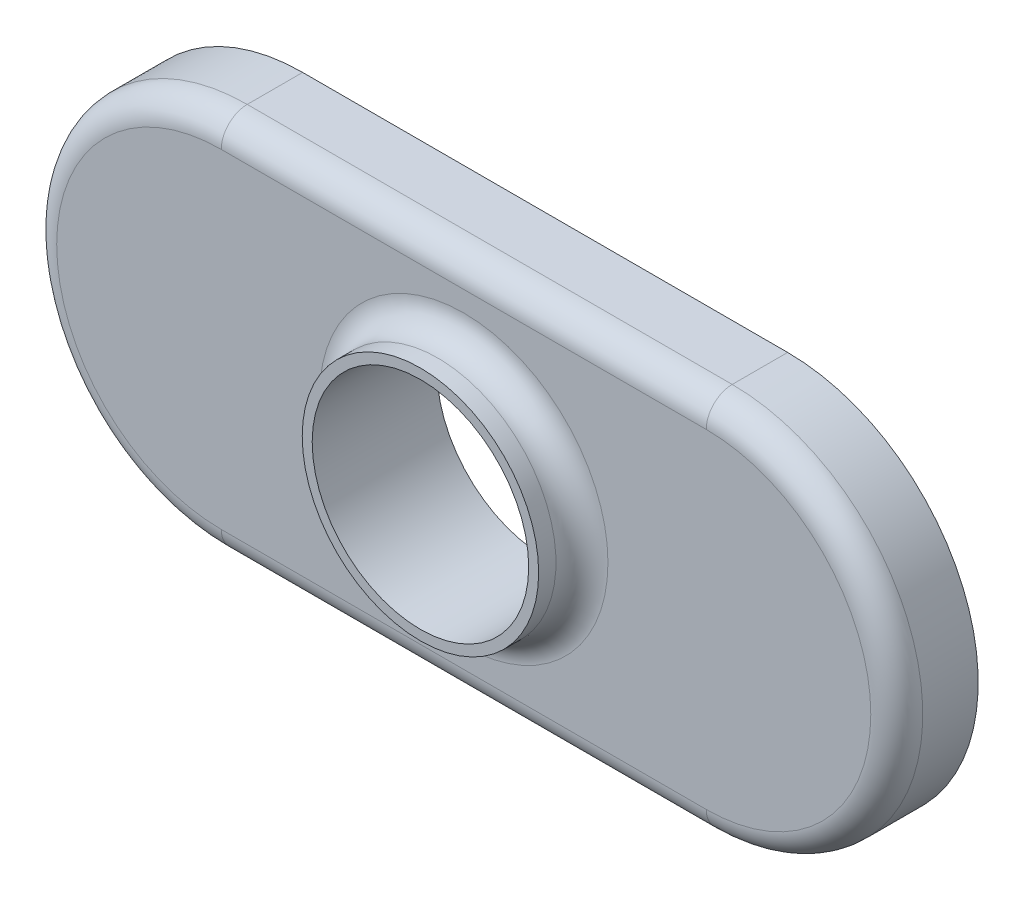
ISO-10303-21;
HEADER;
FILE_DESCRIPTION(('STEP AP214'),'2;1');
FILE_NAME('part.step','',(''),(''),'','','');
FILE_SCHEMA(('AUTOMOTIVE_DESIGN { 1 0 10303 214 1 1 1 1 }'));
ENDSEC;
DATA;
#1=APPLICATION_CONTEXT('core data for automotive mechanical design processes');
#2=APPLICATION_PROTOCOL_DEFINITION('international standard','automotive_design',2000,#1);
#3=PRODUCT_CONTEXT('',#1,'mechanical');
#4=PRODUCT('Part','Part','',(#3));
#5=PRODUCT_RELATED_PRODUCT_CATEGORY('part','',(#4));
#6=PRODUCT_DEFINITION_FORMATION('','',#4);
#7=PRODUCT_DEFINITION_CONTEXT('part definition',#1,'design');
#8=PRODUCT_DEFINITION('design','',#6,#7);
#9=PRODUCT_DEFINITION_SHAPE('','',#8);
#10=(LENGTH_UNIT() NAMED_UNIT(*) SI_UNIT(.MILLI.,.METRE.));
#11=(NAMED_UNIT(*) PLANE_ANGLE_UNIT() SI_UNIT($,.RADIAN.));
#12=(NAMED_UNIT(*) SI_UNIT($,.STERADIAN.) SOLID_ANGLE_UNIT());
#13=UNCERTAINTY_MEASURE_WITH_UNIT(LENGTH_MEASURE(1.E-05),#10,'distance_accuracy_value','');
#14=(GEOMETRIC_REPRESENTATION_CONTEXT(3) GLOBAL_UNCERTAINTY_ASSIGNED_CONTEXT((#13)) GLOBAL_UNIT_ASSIGNED_CONTEXT((#10,
#11,#12)) REPRESENTATION_CONTEXT('',''));
#15=CARTESIAN_POINT('',(0.,0.,0.));
#16=DIRECTION('',(0.,0.,1.));
#17=DIRECTION('',(1.,0.,0.));
#18=AXIS2_PLACEMENT_3D('',#15,#16,#17);
#19=CARTESIAN_POINT('',(0.,11.176,-2.3876));
#20=DIRECTION('',(0.,1.,0.));
#21=DIRECTION('',(-1.,0.,0.));
#22=AXIS2_PLACEMENT_3D('',#19,#20,#21);
#23=PLANE('',#22);
#24=DIRECTION('',(0.,0.,-1.));
#25=VECTOR('',#24,1.);
#26=CARTESIAN_POINT('',(5.588,11.176,37.9720204037097));
#27=LINE('',#26,#25);
#28=CARTESIAN_POINT('',(5.588,11.176,-0.761999999999999));
#29=VERTEX_POINT('',#28);
#30=CARTESIAN_POINT('',(5.588,11.176,-2.3876));
#31=VERTEX_POINT('',#30);
#32=EDGE_CURVE('E137',#29,#31,#27,.T.);
#33=ORIENTED_EDGE('',*,*,#32,.F.);
#34=DIRECTION('',(-1.,0.,0.));
#35=VECTOR('',#34,1.);
#36=CARTESIAN_POINT('',(19.812,11.176,-0.762));
#37=LINE('',#36,#35);
#38=CARTESIAN_POINT('',(19.812,11.176,-0.761999999999999));
#39=VERTEX_POINT('',#38);
#40=EDGE_CURVE('E129',#29,#39,#37,.F.);
#41=ORIENTED_EDGE('',*,*,#40,.T.);
#42=DIRECTION('',(0.,0.,-1.));
#43=VECTOR('',#42,1.);
#44=CARTESIAN_POINT('',(19.812,11.176,37.9720204037097));
#45=LINE('',#44,#43);
#46=CARTESIAN_POINT('',(19.812,11.176,-2.3876));
#47=VERTEX_POINT('',#46);
#48=EDGE_CURVE('E102',#39,#47,#45,.T.);
#49=ORIENTED_EDGE('',*,*,#48,.T.);
#50=DIRECTION('',(-1.,0.,0.));
#51=VECTOR('',#50,1.);
#52=CARTESIAN_POINT('',(0.,11.176,-2.3876));
#53=LINE('',#52,#51);
#54=EDGE_CURVE('E88',#47,#31,#53,.T.);
#55=ORIENTED_EDGE('',*,*,#54,.T.);
#56=EDGE_LOOP('',(#33,#41,#49,#55));
#57=FACE_BOUND('',#56,.T.);
#58=ADVANCED_FACE('F30',(#57),#23,.T.);
#59=CARTESIAN_POINT('',(0.,0.,-2.3876));
#60=DIRECTION('',(0.,0.,-1.));
#61=DIRECTION('',(-1.,0.,0.));
#62=AXIS2_PLACEMENT_3D('',#59,#60,#61);
#63=PLANE('',#62);
#64=CARTESIAN_POINT('',(5.588,5.588,-2.3876));
#65=DIRECTION('',(0.,0.,-1.));
#66=DIRECTION('',(-1.,0.,0.));
#67=AXIS2_PLACEMENT_3D('',#64,#65,#66);
#68=CIRCLE('',#67,5.588);
#69=CARTESIAN_POINT('',(5.588,0.,-2.3876));
#70=VERTEX_POINT('',#69);
#71=EDGE_CURVE('E107',#31,#70,#68,.F.);
#72=ORIENTED_EDGE('',*,*,#71,.F.);
#73=ORIENTED_EDGE('',*,*,#54,.F.);
#74=CARTESIAN_POINT('',(19.812,5.588,-2.3876));
#75=DIRECTION('',(0.,0.,-1.));
#76=DIRECTION('',(-1.,0.,0.));
#77=AXIS2_PLACEMENT_3D('',#74,#75,#76);
#78=CIRCLE('',#77,5.588);
#79=CARTESIAN_POINT('',(19.812,0.,-2.3876));
#80=VERTEX_POINT('',#79);
#81=EDGE_CURVE('E86',#47,#80,#78,.T.);
#82=ORIENTED_EDGE('',*,*,#81,.T.);
#83=DIRECTION('',(1.,0.,0.));
#84=VECTOR('',#83,1.);
#85=CARTESIAN_POINT('',(0.,0.,-2.3876));
#86=LINE('',#85,#84);
#87=EDGE_CURVE('E91',#70,#80,#86,.T.);
#88=ORIENTED_EDGE('',*,*,#87,.F.);
#89=EDGE_LOOP('',(#72,#73,#82,#88));
#90=FACE_BOUND('',#89,.T.);
#91=CARTESIAN_POINT('',(12.7,5.588,-2.3876));
#92=DIRECTION('',(0.,0.,-1.));
#93=DIRECTION('',(-1.,0.,0.));
#94=AXIS2_PLACEMENT_3D('',#91,#92,#93);
#95=CIRCLE('',#94,3.175);
#96=CARTESIAN_POINT('',(9.525,5.588,-2.3876));
#97=VERTEX_POINT('',#96);
#98=EDGE_CURVE('E105',#97,#97,#95,.T.);
#99=ORIENTED_EDGE('',*,*,#98,.F.);
#100=EDGE_LOOP('',(#99));
#101=FACE_BOUND('',#100,.T.);
#102=ADVANCED_FACE('F98',(#90,#101),#63,.T.);
#103=CARTESIAN_POINT('',(0.,0.,0.));
#104=DIRECTION('',(0.,0.,-1.));
#105=DIRECTION('',(-1.,0.,0.));
#106=AXIS2_PLACEMENT_3D('',#103,#104,#105);
#107=PLANE('',#106);
#108=CARTESIAN_POINT('',(19.812,5.588,0.));
#109=DIRECTION('',(0.,0.,-1.));
#110=DIRECTION('',(-1.,0.,0.));
#111=AXIS2_PLACEMENT_3D('',#108,#109,#110);
#112=CIRCLE('',#111,4.826);
#113=CARTESIAN_POINT('',(19.812,0.762,0.));
#114=VERTEX_POINT('',#113);
#115=CARTESIAN_POINT('',(19.812,10.414,0.));
#116=VERTEX_POINT('',#115);
#117=EDGE_CURVE('E124',#114,#116,#112,.F.);
#118=ORIENTED_EDGE('',*,*,#117,.T.);
#119=DIRECTION('',(-1.,0.,0.));
#120=VECTOR('',#119,1.);
#121=CARTESIAN_POINT('',(5.588,10.414,0.));
#122=LINE('',#121,#120);
#123=CARTESIAN_POINT('',(5.588,10.414,0.));
#124=VERTEX_POINT('',#123);
#125=EDGE_CURVE('E126',#116,#124,#122,.T.);
#126=ORIENTED_EDGE('',*,*,#125,.T.);
#127=CARTESIAN_POINT('',(5.588,5.588,0.));
#128=DIRECTION('',(0.,0.,-1.));
#129=DIRECTION('',(-1.,0.,0.));
#130=AXIS2_PLACEMENT_3D('',#127,#128,#129);
#131=CIRCLE('',#130,4.826);
#132=CARTESIAN_POINT('',(5.588,0.762000000000001,0.));
#133=VERTEX_POINT('',#132);
#134=EDGE_CURVE('E120',#124,#133,#131,.F.);
#135=ORIENTED_EDGE('',*,*,#134,.T.);
#136=DIRECTION('',(1.,0.,0.));
#137=VECTOR('',#136,1.);
#138=CARTESIAN_POINT('',(19.812,0.762,0.));
#139=LINE('',#138,#137);
#140=EDGE_CURVE('E122',#133,#114,#139,.T.);
#141=ORIENTED_EDGE('',*,*,#140,.T.);
#142=EDGE_LOOP('',(#118,#126,#135,#141));
#143=FACE_BOUND('',#142,.T.);
#144=CARTESIAN_POINT('',(12.7,5.588,0.));
#145=DIRECTION('',(0.,0.,-1.));
#146=DIRECTION('',(-1.,0.,0.));
#147=AXIS2_PLACEMENT_3D('',#144,#145,#146);
#148=CIRCLE('',#147,4.2291);
#149=CARTESIAN_POINT('',(8.4709,5.588,0.));
#150=VERTEX_POINT('',#149);
#151=EDGE_CURVE('E117',#150,#150,#148,.T.);
#152=ORIENTED_EDGE('',*,*,#151,.T.);
#153=EDGE_LOOP('',(#152));
#154=FACE_BOUND('',#153,.T.);
#155=ADVANCED_FACE('F168',(#143,#154),#107,.F.);
#156=CARTESIAN_POINT('',(0.,0.,-2.3876));
#157=DIRECTION('',(0.,-1.,0.));
#158=DIRECTION('',(0.,0.,-1.));
#159=AXIS2_PLACEMENT_3D('',#156,#157,#158);
#160=PLANE('',#159);
#161=DIRECTION('',(0.,0.,-1.));
#162=VECTOR('',#161,1.);
#163=CARTESIAN_POINT('',(19.812,0.,37.9720204037097));
#164=LINE('',#163,#162);
#165=CARTESIAN_POINT('',(19.812,0.,-0.761999999999999));
#166=VERTEX_POINT('',#165);
#167=EDGE_CURVE('E82',#166,#80,#164,.T.);
#168=ORIENTED_EDGE('',*,*,#167,.F.);
#169=DIRECTION('',(1.,0.,0.));
#170=VECTOR('',#169,1.);
#171=CARTESIAN_POINT('',(5.588,0.,-0.762));
#172=LINE('',#171,#170);
#173=CARTESIAN_POINT('',(5.588,0.,-0.761999999999999));
#174=VERTEX_POINT('',#173);
#175=EDGE_CURVE('E45',#166,#174,#172,.F.);
#176=ORIENTED_EDGE('',*,*,#175,.T.);
#177=DIRECTION('',(0.,0.,-1.));
#178=VECTOR('',#177,1.);
#179=CARTESIAN_POINT('',(5.588,0.,37.9720204037097));
#180=LINE('',#179,#178);
#181=EDGE_CURVE('E87',#70,#174,#180,.F.);
#182=ORIENTED_EDGE('',*,*,#181,.F.);
#183=ORIENTED_EDGE('',*,*,#87,.T.);
#184=EDGE_LOOP('',(#168,#176,#182,#183));
#185=FACE_BOUND('',#184,.T.);
#186=ADVANCED_FACE('F32',(#185),#160,.T.);
#187=CARTESIAN_POINT('',(12.7,5.588,1.27));
#188=DIRECTION('',(0.,0.,-1.));
#189=DIRECTION('',(-1.,0.,0.));
#190=AXIS2_PLACEMENT_3D('',#187,#188,#189);
#191=CYLINDRICAL_SURFACE('',#190,3.4671);
#192=CARTESIAN_POINT('',(12.7,5.588,0.762));
#193=DIRECTION('',(0.,0.,-1.));
#194=DIRECTION('',(-1.,0.,0.));
#195=AXIS2_PLACEMENT_3D('',#192,#193,#194);
#196=CIRCLE('',#195,3.4671);
#197=CARTESIAN_POINT('',(9.2329,5.588,0.762));
#198=VERTEX_POINT('',#197);
#199=EDGE_CURVE('E11',#198,#198,#196,.F.);
#200=ORIENTED_EDGE('',*,*,#199,.T.);
#201=EDGE_LOOP('',(#200));
#202=FACE_BOUND('',#201,.T.);
#203=CARTESIAN_POINT('',(12.7,5.588,1.27));
#204=DIRECTION('',(0.,0.,1.));
#205=DIRECTION('',(1.,0.,0.));
#206=AXIS2_PLACEMENT_3D('',#203,#204,#205);
#207=CIRCLE('',#206,3.4671);
#208=CARTESIAN_POINT('',(16.1671,5.588,1.27));
#209=VERTEX_POINT('',#208);
#210=EDGE_CURVE('E95',#209,#209,#207,.T.);
#211=ORIENTED_EDGE('',*,*,#210,.F.);
#212=EDGE_LOOP('',(#211));
#213=FACE_BOUND('',#212,.T.);
#214=ADVANCED_FACE('F180',(#202,#213),#191,.T.);
#215=CARTESIAN_POINT('',(12.7,5.588,1.27));
#216=DIRECTION('',(0.,0.,1.));
#217=DIRECTION('',(1.,0.,0.));
#218=AXIS2_PLACEMENT_3D('',#215,#216,#217);
#219=PLANE('',#218);
#220=CARTESIAN_POINT('',(12.7,5.588,1.27));
#221=DIRECTION('',(0.,0.,1.));
#222=DIRECTION('',(1.,0.,0.));
#223=AXIS2_PLACEMENT_3D('',#220,#221,#222);
#224=CIRCLE('',#223,3.175);
#225=CARTESIAN_POINT('',(15.875,5.588,1.27));
#226=VERTEX_POINT('',#225);
#227=EDGE_CURVE('E101',#226,#226,#224,.T.);
#228=ORIENTED_EDGE('',*,*,#227,.F.);
#229=EDGE_LOOP('',(#228));
#230=FACE_BOUND('',#229,.T.);
#231=ORIENTED_EDGE('',*,*,#210,.T.);
#232=EDGE_LOOP('',(#231));
#233=FACE_BOUND('',#232,.T.);
#234=ADVANCED_FACE('F183',(#230,#233),#219,.T.);
#235=CARTESIAN_POINT('',(12.7,5.588,1.27));
#236=DIRECTION('',(0.,0.,1.));
#237=DIRECTION('',(1.,0.,0.));
#238=AXIS2_PLACEMENT_3D('',#235,#236,#237);
#239=CYLINDRICAL_SURFACE('',#238,3.175);
#240=ORIENTED_EDGE('',*,*,#98,.T.);
#241=EDGE_LOOP('',(#240));
#242=FACE_BOUND('',#241,.T.);
#243=ORIENTED_EDGE('',*,*,#227,.T.);
#244=EDGE_LOOP('',(#243));
#245=FACE_BOUND('',#244,.T.);
#246=ADVANCED_FACE('F188',(#242,#245),#239,.F.);
#247=CARTESIAN_POINT('',(19.812,5.588,37.9720204037097));
#248=DIRECTION('',(0.,0.,-1.));
#249=DIRECTION('',(-1.,0.,0.));
#250=AXIS2_PLACEMENT_3D('',#247,#248,#249);
#251=CYLINDRICAL_SURFACE('',#250,5.588);
#252=ORIENTED_EDGE('',*,*,#48,.F.);
#253=CARTESIAN_POINT('',(19.812,5.588,-0.761999999999999));
#254=DIRECTION('',(0.,0.,-1.));
#255=DIRECTION('',(-1.,0.,0.));
#256=AXIS2_PLACEMENT_3D('',#253,#254,#255);
#257=CIRCLE('',#256,5.588);
#258=EDGE_CURVE('E53',#39,#166,#257,.T.);
#259=ORIENTED_EDGE('',*,*,#258,.T.);
#260=ORIENTED_EDGE('',*,*,#167,.T.);
#261=ORIENTED_EDGE('',*,*,#81,.F.);
#262=EDGE_LOOP('',(#252,#259,#260,#261));
#263=FACE_BOUND('',#262,.T.);
#264=ADVANCED_FACE('F84',(#263),#251,.T.);
#265=CARTESIAN_POINT('',(5.588,5.588,37.9720204037097));
#266=DIRECTION('',(0.,0.,-1.));
#267=DIRECTION('',(-1.,0.,0.));
#268=AXIS2_PLACEMENT_3D('',#265,#266,#267);
#269=CYLINDRICAL_SURFACE('',#268,5.588);
#270=ORIENTED_EDGE('',*,*,#181,.T.);
#271=CARTESIAN_POINT('',(5.588,5.588,-0.761999999999999));
#272=DIRECTION('',(0.,0.,-1.));
#273=DIRECTION('',(-1.,0.,0.));
#274=AXIS2_PLACEMENT_3D('',#271,#272,#273);
#275=CIRCLE('',#274,5.588);
#276=EDGE_CURVE('E38',#174,#29,#275,.T.);
#277=ORIENTED_EDGE('',*,*,#276,.T.);
#278=ORIENTED_EDGE('',*,*,#32,.T.);
#279=ORIENTED_EDGE('',*,*,#71,.T.);
#280=EDGE_LOOP('',(#270,#277,#278,#279));
#281=FACE_BOUND('',#280,.T.);
#282=ADVANCED_FACE('F136',(#281),#269,.T.);
#283=CARTESIAN_POINT('',(0.,0.762,-0.762));
#284=DIRECTION('',(-1.,0.,0.));
#285=DIRECTION('',(0.,0.,1.));
#286=AXIS2_PLACEMENT_3D('',#283,#284,#285);
#287=CYLINDRICAL_SURFACE('',#286,0.762);
#288=CARTESIAN_POINT('',(5.588,0.762,-0.762));
#289=DIRECTION('',(-1.,0.,0.));
#290=DIRECTION('',(0.,0.,1.));
#291=AXIS2_PLACEMENT_3D('',#288,#289,#290);
#292=CIRCLE('',#291,0.762);
#293=EDGE_CURVE('E155',#174,#133,#292,.T.);
#294=ORIENTED_EDGE('',*,*,#293,.F.);
#295=ORIENTED_EDGE('',*,*,#175,.F.);
#296=CARTESIAN_POINT('',(19.812,0.762,-0.762));
#297=DIRECTION('',(1.,0.,0.));
#298=DIRECTION('',(0.,0.,-1.));
#299=AXIS2_PLACEMENT_3D('',#296,#297,#298);
#300=CIRCLE('',#299,0.762);
#301=EDGE_CURVE('E144',#114,#166,#300,.T.);
#302=ORIENTED_EDGE('',*,*,#301,.F.);
#303=ORIENTED_EDGE('',*,*,#140,.F.);
#304=EDGE_LOOP('',(#294,#295,#302,#303));
#305=FACE_BOUND('',#304,.T.);
#306=ADVANCED_FACE('F166',(#305),#287,.T.);
#307=CARTESIAN_POINT('',(19.812,5.588,-0.761999999999999));
#308=DIRECTION('',(0.,0.,-1.));
#309=DIRECTION('',(-1.,0.,0.));
#310=AXIS2_PLACEMENT_3D('',#307,#308,#309);
#311=TOROIDAL_SURFACE('',#310,4.826,0.762);
#312=ORIENTED_EDGE('',*,*,#301,.T.);
#313=ORIENTED_EDGE('',*,*,#258,.F.);
#314=CARTESIAN_POINT('',(19.812,10.414,-0.762));
#315=DIRECTION('',(-1.,0.,0.));
#316=DIRECTION('',(0.,0.,1.));
#317=AXIS2_PLACEMENT_3D('',#314,#315,#316);
#318=CIRCLE('',#317,0.762);
#319=EDGE_CURVE('E152',#116,#39,#318,.T.);
#320=ORIENTED_EDGE('',*,*,#319,.F.);
#321=ORIENTED_EDGE('',*,*,#117,.F.);
#322=EDGE_LOOP('',(#312,#313,#320,#321));
#323=FACE_BOUND('',#322,.T.);
#324=ADVANCED_FACE('F163',(#323),#311,.T.);
#325=CARTESIAN_POINT('',(5.588,5.588,-0.761999999999999));
#326=DIRECTION('',(0.,0.,-1.));
#327=DIRECTION('',(-1.,0.,0.));
#328=AXIS2_PLACEMENT_3D('',#325,#326,#327);
#329=TOROIDAL_SURFACE('',#328,4.826,0.762);
#330=ORIENTED_EDGE('',*,*,#293,.T.);
#331=ORIENTED_EDGE('',*,*,#134,.F.);
#332=CARTESIAN_POINT('',(5.588,10.414,-0.761999999999999));
#333=DIRECTION('',(1.,0.,0.));
#334=DIRECTION('',(0.,0.,-1.));
#335=AXIS2_PLACEMENT_3D('',#332,#333,#334);
#336=CIRCLE('',#335,0.762);
#337=EDGE_CURVE('E149',#29,#124,#336,.T.);
#338=ORIENTED_EDGE('',*,*,#337,.F.);
#339=ORIENTED_EDGE('',*,*,#276,.F.);
#340=EDGE_LOOP('',(#330,#331,#338,#339));
#341=FACE_BOUND('',#340,.T.);
#342=ADVANCED_FACE('F153',(#341),#329,.T.);
#343=CARTESIAN_POINT('',(0.,10.414,-0.762));
#344=DIRECTION('',(1.,0.,0.));
#345=DIRECTION('',(0.,1.,0.));
#346=AXIS2_PLACEMENT_3D('',#343,#344,#345);
#347=CYLINDRICAL_SURFACE('',#346,0.762);
#348=ORIENTED_EDGE('',*,*,#319,.T.);
#349=ORIENTED_EDGE('',*,*,#40,.F.);
#350=ORIENTED_EDGE('',*,*,#337,.T.);
#351=ORIENTED_EDGE('',*,*,#125,.F.);
#352=EDGE_LOOP('',(#348,#349,#350,#351));
#353=FACE_BOUND('',#352,.T.);
#354=ADVANCED_FACE('F147',(#353),#347,.T.);
#355=CARTESIAN_POINT('',(12.7,5.588,0.762));
#356=DIRECTION('',(0.,0.,-1.));
#357=DIRECTION('',(-1.,0.,0.));
#358=AXIS2_PLACEMENT_3D('',#355,#356,#357);
#359=TOROIDAL_SURFACE('',#358,4.2291,0.762);
#360=ORIENTED_EDGE('',*,*,#151,.F.);
#361=EDGE_LOOP('',(#360));
#362=FACE_BOUND('',#361,.T.);
#363=ORIENTED_EDGE('',*,*,#199,.F.);
#364=EDGE_LOOP('',(#363));
#365=FACE_BOUND('',#364,.T.);
#366=ADVANCED_FACE('F174',(#362,#365),#359,.F.);
#367=CLOSED_SHELL('',(#58,#102,#155,#186,#214,#234,#246,#264,#282,#306,#324,#342,#354,#366));
#368=MANIFOLD_SOLID_BREP('B2',#367);
#369=ADVANCED_BREP_SHAPE_REPRESENTATION('',(#18,#368),#14);
#370=SHAPE_DEFINITION_REPRESENTATION(#9,#369);
ENDSEC;
END-ISO-10303-21;
